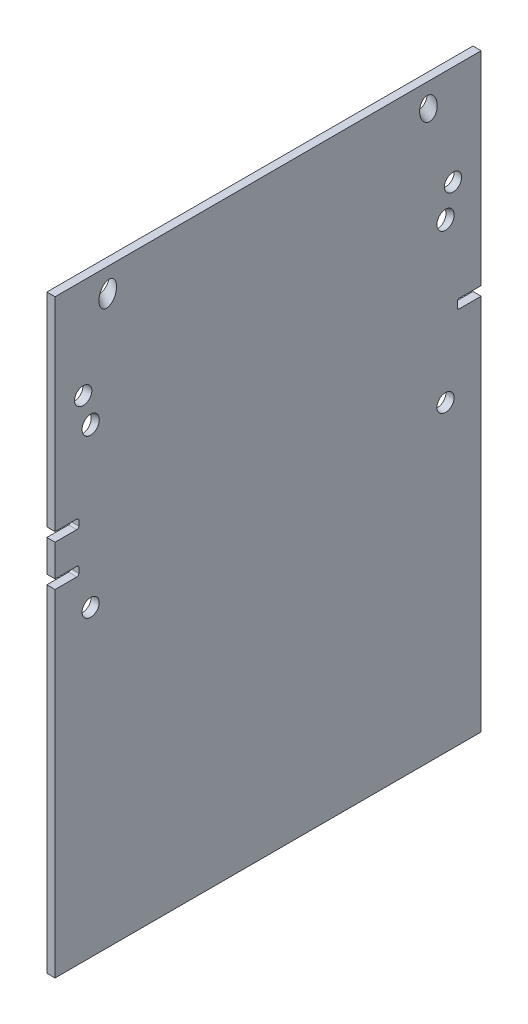
ISO-10303-21;
HEADER;
FILE_DESCRIPTION(('STEP AP214'),'2;1');
FILE_NAME('part.step','',(''),(''),'','','');
FILE_SCHEMA(('AUTOMOTIVE_DESIGN { 1 0 10303 214 1 1 1 1 }'));
ENDSEC;
DATA;
#1=APPLICATION_CONTEXT('core data for automotive mechanical design processes');
#2=APPLICATION_PROTOCOL_DEFINITION('international standard','automotive_design',2000,#1);
#3=PRODUCT_CONTEXT('',#1,'mechanical');
#4=PRODUCT('Part','Part','',(#3));
#5=PRODUCT_RELATED_PRODUCT_CATEGORY('part','',(#4));
#6=PRODUCT_DEFINITION_FORMATION('','',#4);
#7=PRODUCT_DEFINITION_CONTEXT('part definition',#1,'design');
#8=PRODUCT_DEFINITION('design','',#6,#7);
#9=PRODUCT_DEFINITION_SHAPE('','',#8);
#10=(LENGTH_UNIT() NAMED_UNIT(*) SI_UNIT(.MILLI.,.METRE.));
#11=(NAMED_UNIT(*) PLANE_ANGLE_UNIT() SI_UNIT($,.RADIAN.));
#12=(NAMED_UNIT(*) SI_UNIT($,.STERADIAN.) SOLID_ANGLE_UNIT());
#13=UNCERTAINTY_MEASURE_WITH_UNIT(LENGTH_MEASURE(1.E-05),#10,'distance_accuracy_value','');
#14=(GEOMETRIC_REPRESENTATION_CONTEXT(3) GLOBAL_UNCERTAINTY_ASSIGNED_CONTEXT((#13)) GLOBAL_UNIT_ASSIGNED_CONTEXT((#10,
#11,#12)) REPRESENTATION_CONTEXT('',''));
#15=CARTESIAN_POINT('',(0.,0.,0.));
#16=DIRECTION('',(0.,0.,1.));
#17=DIRECTION('',(1.,0.,0.));
#18=AXIS2_PLACEMENT_3D('',#15,#16,#17);
#19=CARTESIAN_POINT('',(2463.8,444.5,330.2));
#20=DIRECTION('',(0.,0.,-1.));
#21=DIRECTION('',(-1.,0.,0.));
#22=AXIS2_PLACEMENT_3D('',#19,#20,#21);
#23=PLANE('',#22);
#24=DIRECTION('',(0.,-1.,0.));
#25=VECTOR('',#24,1.);
#26=CARTESIAN_POINT('',(2463.8,444.5,330.2));
#27=LINE('',#26,#25);
#28=CARTESIAN_POINT('',(2463.8,115.038,330.2));
#29=VERTEX_POINT('',#28);
#30=CARTESIAN_POINT('',(2463.8,65.762,330.2));
#31=VERTEX_POINT('',#30);
#32=EDGE_CURVE('E218',#29,#31,#27,.T.);
#33=ORIENTED_EDGE('',*,*,#32,.T.);
#34=DIRECTION('',(1.,0.,0.));
#35=VECTOR('',#34,1.);
#36=CARTESIAN_POINT('',(2463.8,65.762,330.2));
#37=LINE('',#36,#35);
#38=CARTESIAN_POINT('',(2476.5,65.762,330.2));
#39=VERTEX_POINT('',#38);
#40=EDGE_CURVE('E300',#31,#39,#37,.T.);
#41=ORIENTED_EDGE('',*,*,#40,.T.);
#42=DIRECTION('',(0.,-1.,0.));
#43=VECTOR('',#42,1.);
#44=CARTESIAN_POINT('',(2476.5,444.5,330.2));
#45=LINE('',#44,#43);
#46=CARTESIAN_POINT('',(2476.5,115.038,330.2));
#47=VERTEX_POINT('',#46);
#48=EDGE_CURVE('E248',#47,#39,#45,.T.);
#49=ORIENTED_EDGE('',*,*,#48,.F.);
#50=DIRECTION('',(-1.,0.,0.));
#51=VECTOR('',#50,1.);
#52=CARTESIAN_POINT('',(2463.8,115.038,330.2));
#53=LINE('',#52,#51);
#54=EDGE_CURVE('E289',#47,#29,#53,.T.);
#55=ORIENTED_EDGE('',*,*,#54,.T.);
#56=EDGE_LOOP('',(#33,#41,#49,#55));
#57=FACE_BOUND('',#56,.T.);
#58=ADVANCED_FACE('F43',(#57),#23,.F.);
#59=CARTESIAN_POINT('',(2463.8,444.5,-330.2));
#60=DIRECTION('',(0.,0.,1.));
#61=DIRECTION('',(1.,0.,0.));
#62=AXIS2_PLACEMENT_3D('',#59,#60,#61);
#63=PLANE('',#62);
#64=DIRECTION('',(0.,-1.,0.));
#65=VECTOR('',#64,1.);
#66=CARTESIAN_POINT('',(2463.8,444.5,-330.2));
#67=LINE('',#66,#65);
#68=CARTESIAN_POINT('',(2463.8,115.038,-330.2));
#69=VERTEX_POINT('',#68);
#70=CARTESIAN_POINT('',(2463.8,-469.9,-330.2));
#71=VERTEX_POINT('',#70);
#72=EDGE_CURVE('E237',#69,#71,#67,.T.);
#73=ORIENTED_EDGE('',*,*,#72,.F.);
#74=DIRECTION('',(1.,0.,0.));
#75=VECTOR('',#74,1.);
#76=CARTESIAN_POINT('',(2463.8,115.038,-330.2));
#77=LINE('',#76,#75);
#78=CARTESIAN_POINT('',(2476.5,115.038,-330.2));
#79=VERTEX_POINT('',#78);
#80=EDGE_CURVE('E309',#69,#79,#77,.T.);
#81=ORIENTED_EDGE('',*,*,#80,.T.);
#82=DIRECTION('',(0.,-1.,0.));
#83=VECTOR('',#82,1.);
#84=CARTESIAN_POINT('',(2476.5,444.5,-330.2));
#85=LINE('',#84,#83);
#86=CARTESIAN_POINT('',(2476.5,-469.9,-330.2));
#87=VERTEX_POINT('',#86);
#88=EDGE_CURVE('E245',#79,#87,#85,.T.);
#89=ORIENTED_EDGE('',*,*,#88,.T.);
#90=DIRECTION('',(-1.,0.,0.));
#91=VECTOR('',#90,1.);
#92=CARTESIAN_POINT('',(2463.8,-469.9,-330.2));
#93=LINE('',#92,#91);
#94=EDGE_CURVE('E243',#87,#71,#93,.T.);
#95=ORIENTED_EDGE('',*,*,#94,.T.);
#96=EDGE_LOOP('',(#73,#81,#89,#95));
#97=FACE_BOUND('',#96,.T.);
#98=ADVANCED_FACE('F428',(#97),#63,.F.);
#99=CARTESIAN_POINT('',(2463.8,444.5,330.2));
#100=VERTEX_POINT('',#99);
#101=CARTESIAN_POINT('',(2463.8,129.262,330.2));
#102=VERTEX_POINT('',#101);
#103=EDGE_CURVE('E196',#100,#102,#27,.T.);
#104=ORIENTED_EDGE('',*,*,#103,.T.);
#105=DIRECTION('',(1.,0.,0.));
#106=VECTOR('',#105,1.);
#107=CARTESIAN_POINT('',(2463.8,129.262,330.2));
#108=LINE('',#107,#106);
#109=CARTESIAN_POINT('',(2476.5,129.262,330.2));
#110=VERTEX_POINT('',#109);
#111=EDGE_CURVE('E271',#102,#110,#108,.T.);
#112=ORIENTED_EDGE('',*,*,#111,.T.);
#113=CARTESIAN_POINT('',(2476.5,444.5,330.2));
#114=VERTEX_POINT('',#113);
#115=EDGE_CURVE('E198',#114,#110,#45,.T.);
#116=ORIENTED_EDGE('',*,*,#115,.F.);
#117=DIRECTION('',(1.,0.,0.));
#118=VECTOR('',#117,1.);
#119=CARTESIAN_POINT('',(2463.8,444.5,330.2));
#120=LINE('',#119,#118);
#121=EDGE_CURVE('E191',#100,#114,#120,.T.);
#122=ORIENTED_EDGE('',*,*,#121,.F.);
#123=EDGE_LOOP('',(#104,#112,#116,#122));
#124=FACE_BOUND('',#123,.T.);
#125=ADVANCED_FACE('F193',(#124),#23,.F.);
#126=CARTESIAN_POINT('',(2463.8,444.5,-330.2));
#127=DIRECTION('',(1.,0.,0.));
#128=DIRECTION('',(0.,0.,-1.));
#129=AXIS2_PLACEMENT_3D('',#126,#127,#128);
#130=PLANE('',#129);
#131=DIRECTION('',(0.,0.,-1.));
#132=VECTOR('',#131,1.);
#133=CARTESIAN_POINT('',(2463.8,51.538,-330.2));
#134=LINE('',#133,#132);
#135=CARTESIAN_POINT('',(2463.8,51.538,330.2));
#136=VERTEX_POINT('',#135);
#137=CARTESIAN_POINT('',(2463.8,51.538,296.463));
#138=VERTEX_POINT('',#137);
#139=EDGE_CURVE('E263',#136,#138,#134,.T.);
#140=ORIENTED_EDGE('',*,*,#139,.T.);
#141=CARTESIAN_POINT('',(2463.8,54.713,296.463));
#142=DIRECTION('',(1.,0.,0.));
#143=DIRECTION('',(0.,0.,-1.));
#144=AXIS2_PLACEMENT_3D('',#141,#142,#143);
#145=CIRCLE('',#144,3.175);
#146=CARTESIAN_POINT('',(2463.8,54.713,293.288));
#147=VERTEX_POINT('',#146);
#148=EDGE_CURVE('E401',#138,#147,#145,.T.);
#149=ORIENTED_EDGE('',*,*,#148,.T.);
#150=DIRECTION('',(0.,1.,0.));
#151=VECTOR('',#150,1.);
#152=CARTESIAN_POINT('',(2463.8,52.3,293.288));
#153=LINE('',#152,#151);
#154=CARTESIAN_POINT('',(2463.8,62.587,293.288));
#155=VERTEX_POINT('',#154);
#156=EDGE_CURVE('E264',#147,#155,#153,.T.);
#157=ORIENTED_EDGE('',*,*,#156,.T.);
#158=CARTESIAN_POINT('',(2463.8,62.587,296.463));
#159=DIRECTION('',(1.,0.,0.));
#160=DIRECTION('',(0.,0.,-1.));
#161=AXIS2_PLACEMENT_3D('',#158,#159,#160);
#162=CIRCLE('',#161,3.175);
#163=CARTESIAN_POINT('',(2463.8,65.762,296.463));
#164=VERTEX_POINT('',#163);
#165=EDGE_CURVE('E405',#155,#164,#162,.T.);
#166=ORIENTED_EDGE('',*,*,#165,.T.);
#167=DIRECTION('',(0.,0.,1.));
#168=VECTOR('',#167,1.);
#169=CARTESIAN_POINT('',(2463.8,65.762,-330.2));
#170=LINE('',#169,#168);
#171=EDGE_CURVE('E297',#164,#31,#170,.T.);
#172=ORIENTED_EDGE('',*,*,#171,.T.);
#173=ORIENTED_EDGE('',*,*,#32,.F.);
#174=DIRECTION('',(0.,0.,-1.));
#175=VECTOR('',#174,1.);
#176=CARTESIAN_POINT('',(2463.8,115.038,-330.2));
#177=LINE('',#176,#175);
#178=CARTESIAN_POINT('',(2463.8,115.038,296.463));
#179=VERTEX_POINT('',#178);
#180=EDGE_CURVE('E273',#29,#179,#177,.T.);
#181=ORIENTED_EDGE('',*,*,#180,.T.);
#182=CARTESIAN_POINT('',(2463.8,118.213,296.463));
#183=DIRECTION('',(1.,0.,0.));
#184=DIRECTION('',(0.,0.,-1.));
#185=AXIS2_PLACEMENT_3D('',#182,#183,#184);
#186=CIRCLE('',#185,3.175);
#187=CARTESIAN_POINT('',(2463.8,118.213,293.288));
#188=VERTEX_POINT('',#187);
#189=EDGE_CURVE('E397',#179,#188,#186,.T.);
#190=ORIENTED_EDGE('',*,*,#189,.T.);
#191=DIRECTION('',(0.,1.,0.));
#192=VECTOR('',#191,1.);
#193=CARTESIAN_POINT('',(2463.8,115.8,293.288));
#194=LINE('',#193,#192);
#195=CARTESIAN_POINT('',(2463.8,126.087,293.288));
#196=VERTEX_POINT('',#195);
#197=EDGE_CURVE('E276',#188,#196,#194,.T.);
#198=ORIENTED_EDGE('',*,*,#197,.T.);
#199=CARTESIAN_POINT('',(2463.8,126.087,296.463));
#200=DIRECTION('',(1.,0.,0.));
#201=DIRECTION('',(0.,0.,-1.));
#202=AXIS2_PLACEMENT_3D('',#199,#200,#201);
#203=CIRCLE('',#202,3.175);
#204=CARTESIAN_POINT('',(2463.8,129.262,296.463));
#205=VERTEX_POINT('',#204);
#206=EDGE_CURVE('E12',#196,#205,#203,.T.);
#207=ORIENTED_EDGE('',*,*,#206,.T.);
#208=DIRECTION('',(0.,0.,1.));
#209=VECTOR('',#208,1.);
#210=CARTESIAN_POINT('',(2463.8,129.262,-330.2));
#211=LINE('',#210,#209);
#212=EDGE_CURVE('E215',#205,#102,#211,.T.);
#213=ORIENTED_EDGE('',*,*,#212,.T.);
#214=ORIENTED_EDGE('',*,*,#103,.F.);
#215=DIRECTION('',(0.,0.,1.));
#216=VECTOR('',#215,1.);
#217=CARTESIAN_POINT('',(2463.8,444.5,-330.2));
#218=LINE('',#217,#216);
#219=CARTESIAN_POINT('',(2463.8,444.5,-330.2));
#220=VERTEX_POINT('',#219);
#221=EDGE_CURVE('E202',#220,#100,#218,.T.);
#222=ORIENTED_EDGE('',*,*,#221,.F.);
#223=CARTESIAN_POINT('',(2463.8,129.262,-330.2));
#224=VERTEX_POINT('',#223);
#225=EDGE_CURVE('E233',#220,#224,#67,.T.);
#226=ORIENTED_EDGE('',*,*,#225,.T.);
#227=DIRECTION('',(0.,0.,1.));
#228=VECTOR('',#227,1.);
#229=CARTESIAN_POINT('',(2463.8,129.262,-330.2));
#230=LINE('',#229,#228);
#231=CARTESIAN_POINT('',(2463.8,129.262,-296.463000000001));
#232=VERTEX_POINT('',#231);
#233=EDGE_CURVE('E795',#224,#232,#230,.T.);
#234=ORIENTED_EDGE('',*,*,#233,.T.);
#235=CARTESIAN_POINT('',(2463.8,126.087,-296.463000000001));
#236=DIRECTION('',(1.,0.,0.));
#237=DIRECTION('',(0.,0.,-1.));
#238=AXIS2_PLACEMENT_3D('',#235,#236,#237);
#239=CIRCLE('',#238,3.175);
#240=CARTESIAN_POINT('',(2463.8,126.087,-293.288000000001));
#241=VERTEX_POINT('',#240);
#242=EDGE_CURVE('E393',#232,#241,#239,.T.);
#243=ORIENTED_EDGE('',*,*,#242,.T.);
#244=DIRECTION('',(0.,-1.,0.));
#245=VECTOR('',#244,1.);
#246=CARTESIAN_POINT('',(2463.8,128.5,-293.288000000001));
#247=LINE('',#246,#245);
#248=CARTESIAN_POINT('',(2463.8,118.213,-293.288000000001));
#249=VERTEX_POINT('',#248);
#250=EDGE_CURVE('E796',#241,#249,#247,.T.);
#251=ORIENTED_EDGE('',*,*,#250,.T.);
#252=CARTESIAN_POINT('',(2463.8,118.213,-296.463000000001));
#253=DIRECTION('',(1.,0.,0.));
#254=DIRECTION('',(0.,0.,-1.));
#255=AXIS2_PLACEMENT_3D('',#252,#253,#254);
#256=CIRCLE('',#255,3.175);
#257=CARTESIAN_POINT('',(2463.8,115.038,-296.463000000001));
#258=VERTEX_POINT('',#257);
#259=EDGE_CURVE('E389',#249,#258,#256,.T.);
#260=ORIENTED_EDGE('',*,*,#259,.T.);
#261=DIRECTION('',(0.,0.,-1.));
#262=VECTOR('',#261,1.);
#263=CARTESIAN_POINT('',(2463.8,115.038,-330.2));
#264=LINE('',#263,#262);
#265=EDGE_CURVE('E286',#258,#69,#264,.T.);
#266=ORIENTED_EDGE('',*,*,#265,.T.);
#267=ORIENTED_EDGE('',*,*,#72,.T.);
#268=DIRECTION('',(0.,0.,1.));
#269=VECTOR('',#268,1.);
#270=CARTESIAN_POINT('',(2463.8,-469.9,-330.2));
#271=LINE('',#270,#269);
#272=CARTESIAN_POINT('',(2463.8,-469.9,330.2));
#273=VERTEX_POINT('',#272);
#274=EDGE_CURVE('E240',#71,#273,#271,.T.);
#275=ORIENTED_EDGE('',*,*,#274,.T.);
#276=EDGE_CURVE('E220',#136,#273,#27,.T.);
#277=ORIENTED_EDGE('',*,*,#276,.F.);
#278=EDGE_LOOP('',(#140,#149,#157,#166,#172,#173,#181,#190,#198,#207,#213,#214,#222,#226,#234,
#243,#251,#260,#266,#267,#275,#277));
#279=FACE_BOUND('',#278,.T.);
#280=CARTESIAN_POINT('',(2463.8,240.627500000009,-275.000000000001));
#281=DIRECTION('',(1.,0.,0.));
#282=DIRECTION('',(0.,1.,0.));
#283=AXIS2_PLACEMENT_3D('',#280,#281,#282);
#284=ELLIPSE('',#283,14.1841170593698,13.335);
#285=CARTESIAN_POINT('',(2463.8,254.811617059379,-275.000000000001));
#286=VERTEX_POINT('',#285);
#287=EDGE_CURVE('E288',#286,#286,#284,.F.);
#288=ORIENTED_EDGE('',*,*,#287,.F.);
#289=EDGE_LOOP('',(#288));
#290=FACE_BOUND('',#289,.T.);
#291=CARTESIAN_POINT('',(2463.8,-7.12133119048504E-13,-275.000000000001));
#292=DIRECTION('',(1.,0.,0.));
#293=DIRECTION('',(0.,0.,-1.));
#294=AXIS2_PLACEMENT_3D('',#291,#292,#293);
#295=CIRCLE('',#294,13.335);
#296=CARTESIAN_POINT('',(2463.8,-7.12133119048504E-13,-288.335000000001));
#297=VERTEX_POINT('',#296);
#298=EDGE_CURVE('E346',#297,#297,#295,.F.);
#299=ORIENTED_EDGE('',*,*,#298,.F.);
#300=EDGE_LOOP('',(#299));
#301=FACE_BOUND('',#300,.T.);
#302=CARTESIAN_POINT('',(2463.8,289.999999999994,-287.768749999998));
#303=DIRECTION('',(1.,0.,0.));
#304=DIRECTION('',(0.,-1.68753899743025E-13,-1.));
#305=AXIS2_PLACEMENT_3D('',#302,#303,#304);
#306=ELLIPSE('',#305,13.3934728748526,13.335);
#307=CARTESIAN_POINT('',(2463.8,289.999999999991,-301.16222287485));
#308=VERTEX_POINT('',#307);
#309=EDGE_CURVE('E347',#308,#308,#306,.F.);
#310=ORIENTED_EDGE('',*,*,#309,.F.);
#311=EDGE_LOOP('',(#310));
#312=FACE_BOUND('',#311,.T.);
#313=CARTESIAN_POINT('',(2463.8,419.804647774969,-245.782156472755));
#314=DIRECTION('',(1.,0.,0.));
#315=DIRECTION('',(0.,0.975590762994734,0.219596591866432));
#316=AXIS2_PLACEMENT_3D('',#313,#314,#315);
#317=ELLIPSE('',#316,18.6418967373264,13.3350000000001);
#318=CARTESIAN_POINT('',(2463.8,437.991510036606,-241.688459483312));
#319=VERTEX_POINT('',#318);
#320=EDGE_CURVE('E315',#319,#319,#317,.F.);
#321=ORIENTED_EDGE('',*,*,#320,.F.);
#322=EDGE_LOOP('',(#321));
#323=FACE_BOUND('',#322,.T.);
#324=CARTESIAN_POINT('',(2463.8,419.804647774969,245.782156472754));
#325=DIRECTION('',(1.,0.,0.));
#326=DIRECTION('',(0.,-0.975590762994734,0.219596591866431));
#327=AXIS2_PLACEMENT_3D('',#324,#325,#326);
#328=ELLIPSE('',#327,18.6418967373263,13.335);
#329=CARTESIAN_POINT('',(2463.8,401.617785513332,249.875853462197));
#330=VERTEX_POINT('',#329);
#331=EDGE_CURVE('E316',#330,#330,#328,.F.);
#332=ORIENTED_EDGE('',*,*,#331,.F.);
#333=EDGE_LOOP('',(#332));
#334=FACE_BOUND('',#333,.T.);
#335=CARTESIAN_POINT('',(2463.8,240.627500000009,275.));
#336=DIRECTION('',(1.,0.,0.));
#337=DIRECTION('',(0.,-1.,0.));
#338=AXIS2_PLACEMENT_3D('',#335,#336,#337);
#339=ELLIPSE('',#338,14.1841170593698,13.335);
#340=CARTESIAN_POINT('',(2463.8,226.443382940639,275.));
#341=VERTEX_POINT('',#340);
#342=EDGE_CURVE('E323',#341,#341,#339,.F.);
#343=ORIENTED_EDGE('',*,*,#342,.F.);
#344=EDGE_LOOP('',(#343));
#345=FACE_BOUND('',#344,.T.);
#346=CARTESIAN_POINT('',(2463.8,-4.18286707223905E-12,275.));
#347=DIRECTION('',(1.,0.,0.));
#348=DIRECTION('',(0.,0.,-1.));
#349=AXIS2_PLACEMENT_3D('',#346,#347,#348);
#350=CIRCLE('',#349,13.335);
#351=CARTESIAN_POINT('',(2463.8,-4.18286707223905E-12,261.665));
#352=VERTEX_POINT('',#351);
#353=EDGE_CURVE('E336',#352,#352,#350,.F.);
#354=ORIENTED_EDGE('',*,*,#353,.F.);
#355=EDGE_LOOP('',(#354));
#356=FACE_BOUND('',#355,.T.);
#357=CARTESIAN_POINT('',(2463.8,289.999999999994,287.768749999997));
#358=DIRECTION('',(1.,0.,0.));
#359=DIRECTION('',(0.,-1.70234197109192E-13,1.));
#360=AXIS2_PLACEMENT_3D('',#357,#358,#359);
#361=ELLIPSE('',#360,13.3934728748526,13.335);
#362=CARTESIAN_POINT('',(2463.8,289.999999999991,301.162222874849));
#363=VERTEX_POINT('',#362);
#364=EDGE_CURVE('E329',#363,#363,#361,.F.);
#365=ORIENTED_EDGE('',*,*,#364,.F.);
#366=EDGE_LOOP('',(#365));
#367=FACE_BOUND('',#366,.T.);
#368=ADVANCED_FACE('F213',(#279,#290,#301,#312,#323,#334,#345,#356,#367),#130,.F.);
#369=CARTESIAN_POINT('',(2476.5,51.538,330.2));
#370=VERTEX_POINT('',#369);
#371=CARTESIAN_POINT('',(2476.5,-469.9,330.2));
#372=VERTEX_POINT('',#371);
#373=EDGE_CURVE('E222',#370,#372,#45,.T.);
#374=ORIENTED_EDGE('',*,*,#373,.F.);
#375=DIRECTION('',(-1.,0.,0.));
#376=VECTOR('',#375,1.);
#377=CARTESIAN_POINT('',(2463.8,51.538,330.2));
#378=LINE('',#377,#376);
#379=EDGE_CURVE('E261',#370,#136,#378,.T.);
#380=ORIENTED_EDGE('',*,*,#379,.T.);
#381=ORIENTED_EDGE('',*,*,#276,.T.);
#382=DIRECTION('',(1.,0.,0.));
#383=VECTOR('',#382,1.);
#384=CARTESIAN_POINT('',(2463.8,-469.9,330.2));
#385=LINE('',#384,#383);
#386=EDGE_CURVE('E227',#273,#372,#385,.T.);
#387=ORIENTED_EDGE('',*,*,#386,.T.);
#388=EDGE_LOOP('',(#374,#380,#381,#387));
#389=FACE_BOUND('',#388,.T.);
#390=ADVANCED_FACE('F260',(#389),#23,.F.);
#391=CARTESIAN_POINT('',(2476.5,444.5,-330.2));
#392=DIRECTION('',(-1.,0.,0.));
#393=DIRECTION('',(0.,0.,1.));
#394=AXIS2_PLACEMENT_3D('',#391,#392,#393);
#395=PLANE('',#394);
#396=DIRECTION('',(0.,1.,0.));
#397=VECTOR('',#396,1.);
#398=CARTESIAN_POINT('',(2476.5,444.5,293.288));
#399=LINE('',#398,#397);
#400=CARTESIAN_POINT('',(2476.5,54.713,293.288));
#401=VERTEX_POINT('',#400);
#402=CARTESIAN_POINT('',(2476.5,62.5869999999999,293.288));
#403=VERTEX_POINT('',#402);
#404=EDGE_CURVE('E296',#401,#403,#399,.T.);
#405=ORIENTED_EDGE('',*,*,#404,.F.);
#406=CARTESIAN_POINT('',(2476.5,54.713,296.463));
#407=DIRECTION('',(-1.,0.,0.));
#408=DIRECTION('',(0.,0.,1.));
#409=AXIS2_PLACEMENT_3D('',#406,#407,#408);
#410=CIRCLE('',#409,3.175);
#411=CARTESIAN_POINT('',(2476.5,51.538,296.463));
#412=VERTEX_POINT('',#411);
#413=EDGE_CURVE('E399',#401,#412,#410,.T.);
#414=ORIENTED_EDGE('',*,*,#413,.T.);
#415=DIRECTION('',(0.,0.,1.));
#416=VECTOR('',#415,1.);
#417=CARTESIAN_POINT('',(2476.5,51.538,-330.2));
#418=LINE('',#417,#416);
#419=EDGE_CURVE('E258',#412,#370,#418,.T.);
#420=ORIENTED_EDGE('',*,*,#419,.T.);
#421=ORIENTED_EDGE('',*,*,#373,.T.);
#422=DIRECTION('',(0.,0.,-1.));
#423=VECTOR('',#422,1.);
#424=CARTESIAN_POINT('',(2476.5,-469.9,-330.2));
#425=LINE('',#424,#423);
#426=EDGE_CURVE('E217',#372,#87,#425,.T.);
#427=ORIENTED_EDGE('',*,*,#426,.T.);
#428=ORIENTED_EDGE('',*,*,#88,.F.);
#429=DIRECTION('',(0.,0.,1.));
#430=VECTOR('',#429,1.);
#431=CARTESIAN_POINT('',(2476.5,115.038,-330.2));
#432=LINE('',#431,#430);
#433=CARTESIAN_POINT('',(2476.5,115.038,-296.463000000001));
#434=VERTEX_POINT('',#433);
#435=EDGE_CURVE('E803',#79,#434,#432,.T.);
#436=ORIENTED_EDGE('',*,*,#435,.T.);
#437=CARTESIAN_POINT('',(2476.5,118.213,-296.463000000001));
#438=DIRECTION('',(-1.,0.,0.));
#439=DIRECTION('',(0.,0.,1.));
#440=AXIS2_PLACEMENT_3D('',#437,#438,#439);
#441=CIRCLE('',#440,3.175);
#442=CARTESIAN_POINT('',(2476.5,118.213,-293.288000000001));
#443=VERTEX_POINT('',#442);
#444=EDGE_CURVE('E387',#434,#443,#441,.T.);
#445=ORIENTED_EDGE('',*,*,#444,.T.);
#446=DIRECTION('',(0.,-1.,0.));
#447=VECTOR('',#446,1.);
#448=CARTESIAN_POINT('',(2476.5,444.5,-293.288000000001));
#449=LINE('',#448,#447);
#450=CARTESIAN_POINT('',(2476.5,126.087,-293.288000000001));
#451=VERTEX_POINT('',#450);
#452=EDGE_CURVE('E299',#451,#443,#449,.T.);
#453=ORIENTED_EDGE('',*,*,#452,.F.);
#454=CARTESIAN_POINT('',(2476.5,126.087,-296.463000000001));
#455=DIRECTION('',(-1.,0.,0.));
#456=DIRECTION('',(0.,0.,1.));
#457=AXIS2_PLACEMENT_3D('',#454,#455,#456);
#458=CIRCLE('',#457,3.175);
#459=CARTESIAN_POINT('',(2476.5,129.262,-296.463000000001));
#460=VERTEX_POINT('',#459);
#461=EDGE_CURVE('E391',#451,#460,#458,.T.);
#462=ORIENTED_EDGE('',*,*,#461,.T.);
#463=DIRECTION('',(0.,0.,-1.));
#464=VECTOR('',#463,1.);
#465=CARTESIAN_POINT('',(2476.5,129.262,-330.2));
#466=LINE('',#465,#464);
#467=CARTESIAN_POINT('',(2476.5,129.262,-330.2));
#468=VERTEX_POINT('',#467);
#469=EDGE_CURVE('E792',#460,#468,#466,.T.);
#470=ORIENTED_EDGE('',*,*,#469,.T.);
#471=CARTESIAN_POINT('',(2476.5,444.5,-330.2));
#472=VERTEX_POINT('',#471);
#473=EDGE_CURVE('E210',#472,#468,#85,.T.);
#474=ORIENTED_EDGE('',*,*,#473,.F.);
#475=DIRECTION('',(0.,0.,-1.));
#476=VECTOR('',#475,1.);
#477=CARTESIAN_POINT('',(2476.5,444.5,-330.2));
#478=LINE('',#477,#476);
#479=EDGE_CURVE('E201',#114,#472,#478,.T.);
#480=ORIENTED_EDGE('',*,*,#479,.F.);
#481=ORIENTED_EDGE('',*,*,#115,.T.);
#482=DIRECTION('',(0.,0.,-1.));
#483=VECTOR('',#482,1.);
#484=CARTESIAN_POINT('',(2476.5,129.262,-330.2));
#485=LINE('',#484,#483);
#486=CARTESIAN_POINT('',(2476.5,129.262,296.463));
#487=VERTEX_POINT('',#486);
#488=EDGE_CURVE('E279',#110,#487,#485,.T.);
#489=ORIENTED_EDGE('',*,*,#488,.T.);
#490=CARTESIAN_POINT('',(2476.5,126.087,296.463));
#491=DIRECTION('',(-1.,0.,0.));
#492=DIRECTION('',(0.,0.,1.));
#493=AXIS2_PLACEMENT_3D('',#490,#491,#492);
#494=CIRCLE('',#493,3.175);
#495=CARTESIAN_POINT('',(2476.5,126.087,293.288));
#496=VERTEX_POINT('',#495);
#497=EDGE_CURVE('E51',#487,#496,#494,.T.);
#498=ORIENTED_EDGE('',*,*,#497,.T.);
#499=DIRECTION('',(0.,1.,0.));
#500=VECTOR('',#499,1.);
#501=CARTESIAN_POINT('',(2476.5,444.5,293.288));
#502=LINE('',#501,#500);
#503=CARTESIAN_POINT('',(2476.5,118.213,293.288));
#504=VERTEX_POINT('',#503);
#505=EDGE_CURVE('E283',#504,#496,#502,.T.);
#506=ORIENTED_EDGE('',*,*,#505,.F.);
#507=CARTESIAN_POINT('',(2476.5,118.213,296.463));
#508=DIRECTION('',(-1.,0.,0.));
#509=DIRECTION('',(0.,0.,1.));
#510=AXIS2_PLACEMENT_3D('',#507,#508,#509);
#511=CIRCLE('',#510,3.175);
#512=CARTESIAN_POINT('',(2476.5,115.038,296.463));
#513=VERTEX_POINT('',#512);
#514=EDGE_CURVE('E395',#504,#513,#511,.T.);
#515=ORIENTED_EDGE('',*,*,#514,.T.);
#516=DIRECTION('',(0.,0.,1.));
#517=VECTOR('',#516,1.);
#518=CARTESIAN_POINT('',(2476.5,115.038,-330.2));
#519=LINE('',#518,#517);
#520=EDGE_CURVE('E282',#513,#47,#519,.T.);
#521=ORIENTED_EDGE('',*,*,#520,.T.);
#522=ORIENTED_EDGE('',*,*,#48,.T.);
#523=DIRECTION('',(0.,0.,-1.));
#524=VECTOR('',#523,1.);
#525=CARTESIAN_POINT('',(2476.5,65.762,-330.2));
#526=LINE('',#525,#524);
#527=CARTESIAN_POINT('',(2476.5,65.762,296.463));
#528=VERTEX_POINT('',#527);
#529=EDGE_CURVE('E303',#39,#528,#526,.T.);
#530=ORIENTED_EDGE('',*,*,#529,.T.);
#531=CARTESIAN_POINT('',(2476.5,62.587,296.463));
#532=DIRECTION('',(-1.,0.,0.));
#533=DIRECTION('',(0.,0.,1.));
#534=AXIS2_PLACEMENT_3D('',#531,#532,#533);
#535=CIRCLE('',#534,3.175);
#536=EDGE_CURVE('E403',#528,#403,#535,.T.);
#537=ORIENTED_EDGE('',*,*,#536,.T.);
#538=EDGE_LOOP('',(#405,#414,#420,#421,#427,#428,#436,#445,#453,#462,#470,#474,#480,#481,#489,
#498,#506,#515,#521,#522,#530,#537));
#539=FACE_BOUND('',#538,.T.);
#540=CARTESIAN_POINT('',(2476.5,245.231250000009,-275.000000000001));
#541=DIRECTION('',(-1.,0.,0.));
#542=DIRECTION('',(0.,1.,0.));
#543=AXIS2_PLACEMENT_3D('',#540,#541,#542);
#544=ELLIPSE('',#543,14.1841170593698,13.335);
#545=CARTESIAN_POINT('',(2476.5,259.415367059379,-275.000000000001));
#546=VERTEX_POINT('',#545);
#547=EDGE_CURVE('E350',#546,#546,#544,.F.);
#548=ORIENTED_EDGE('',*,*,#547,.F.);
#549=EDGE_LOOP('',(#548));
#550=FACE_BOUND('',#549,.T.);
#551=CARTESIAN_POINT('',(2476.5,-6.45730104276708E-13,-275.000000000001));
#552=DIRECTION('',(-1.,0.,0.));
#553=DIRECTION('',(0.,0.,1.));
#554=AXIS2_PLACEMENT_3D('',#551,#552,#553);
#555=CIRCLE('',#554,13.335);
#556=CARTESIAN_POINT('',(2476.5,-6.45730104276708E-13,-261.665000000001));
#557=VERTEX_POINT('',#556);
#558=EDGE_CURVE('E343',#557,#557,#555,.F.);
#559=ORIENTED_EDGE('',*,*,#558,.F.);
#560=EDGE_LOOP('',(#559));
#561=FACE_BOUND('',#560,.T.);
#562=CARTESIAN_POINT('',(2476.5,289.999999999994,-286.578124999997));
#563=DIRECTION('',(-1.,0.,0.));
#564=DIRECTION('',(0.,-1.68753899743025E-13,-1.));
#565=AXIS2_PLACEMENT_3D('',#562,#563,#564);
#566=ELLIPSE('',#565,13.3934728748526,13.335);
#567=CARTESIAN_POINT('',(2476.5,289.999999999991,-299.97159787485));
#568=VERTEX_POINT('',#567);
#569=EDGE_CURVE('E319',#568,#568,#566,.F.);
#570=ORIENTED_EDGE('',*,*,#569,.F.);
#571=EDGE_LOOP('',(#570));
#572=FACE_BOUND('',#571,.T.);
#573=CARTESIAN_POINT('',(2476.5,407.700983848811,-248.506580942624));
#574=DIRECTION('',(-1.,0.,0.));
#575=DIRECTION('',(0.,0.975590762994734,0.219596591866432));
#576=AXIS2_PLACEMENT_3D('',#573,#574,#575);
#577=ELLIPSE('',#576,18.6418967373264,13.3350000000001);
#578=CARTESIAN_POINT('',(2476.5,425.887846110449,-244.412883953181));
#579=VERTEX_POINT('',#578);
#580=EDGE_CURVE('E312',#579,#579,#577,.F.);
#581=ORIENTED_EDGE('',*,*,#580,.F.);
#582=EDGE_LOOP('',(#581));
#583=FACE_BOUND('',#582,.T.);
#584=CARTESIAN_POINT('',(2476.5,407.700983848812,248.506580942623));
#585=DIRECTION('',(-1.,0.,0.));
#586=DIRECTION('',(0.,-0.975590762994734,0.219596591866431));
#587=AXIS2_PLACEMENT_3D('',#584,#585,#586);
#588=ELLIPSE('',#587,18.6418967373263,13.335);
#589=CARTESIAN_POINT('',(2476.5,389.514121587175,252.600277932066));
#590=VERTEX_POINT('',#589);
#591=EDGE_CURVE('E320',#590,#590,#588,.F.);
#592=ORIENTED_EDGE('',*,*,#591,.F.);
#593=EDGE_LOOP('',(#592));
#594=FACE_BOUND('',#593,.T.);
#595=CARTESIAN_POINT('',(2476.5,245.231250000009,275.));
#596=DIRECTION('',(-1.,0.,0.));
#597=DIRECTION('',(0.,-1.,0.));
#598=AXIS2_PLACEMENT_3D('',#595,#596,#597);
#599=ELLIPSE('',#598,14.1841170593698,13.335);
#600=CARTESIAN_POINT('',(2476.5,231.047132940639,275.));
#601=VERTEX_POINT('',#600);
#602=EDGE_CURVE('E333',#601,#601,#599,.F.);
#603=ORIENTED_EDGE('',*,*,#602,.F.);
#604=EDGE_LOOP('',(#603));
#605=FACE_BOUND('',#604,.T.);
#606=CARTESIAN_POINT('',(2476.5,-4.18286707223905E-12,275.));
#607=DIRECTION('',(-1.,0.,0.));
#608=DIRECTION('',(0.,0.,1.));
#609=AXIS2_PLACEMENT_3D('',#606,#607,#608);
#610=CIRCLE('',#609,13.335);
#611=CARTESIAN_POINT('',(2476.5,-4.18286707223905E-12,288.335));
#612=VERTEX_POINT('',#611);
#613=EDGE_CURVE('E332',#612,#612,#610,.F.);
#614=ORIENTED_EDGE('',*,*,#613,.F.);
#615=EDGE_LOOP('',(#614));
#616=FACE_BOUND('',#615,.T.);
#617=CARTESIAN_POINT('',(2476.5,289.999999999994,286.578124999997));
#618=DIRECTION('',(-1.,0.,0.));
#619=DIRECTION('',(0.,-1.70234197109192E-13,1.));
#620=AXIS2_PLACEMENT_3D('',#617,#618,#619);
#621=ELLIPSE('',#620,13.3934728748526,13.335);
#622=CARTESIAN_POINT('',(2476.5,289.999999999992,299.971597874849));
#623=VERTEX_POINT('',#622);
#624=EDGE_CURVE('E326',#623,#623,#621,.F.);
#625=ORIENTED_EDGE('',*,*,#624,.F.);
#626=EDGE_LOOP('',(#625));
#627=FACE_BOUND('',#626,.T.);
#628=ADVANCED_FACE('F253',(#539,#550,#561,#572,#583,#594,#605,#616,#627),#395,.F.);
#629=ORIENTED_EDGE('',*,*,#473,.T.);
#630=DIRECTION('',(-1.,0.,0.));
#631=VECTOR('',#630,1.);
#632=CARTESIAN_POINT('',(2463.8,129.262,-330.2));
#633=LINE('',#632,#631);
#634=EDGE_CURVE('E281',#468,#224,#633,.T.);
#635=ORIENTED_EDGE('',*,*,#634,.T.);
#636=ORIENTED_EDGE('',*,*,#225,.F.);
#637=DIRECTION('',(-1.,0.,0.));
#638=VECTOR('',#637,1.);
#639=CARTESIAN_POINT('',(2463.8,444.5,-330.2));
#640=LINE('',#639,#638);
#641=EDGE_CURVE('E207',#472,#220,#640,.T.);
#642=ORIENTED_EDGE('',*,*,#641,.F.);
#643=EDGE_LOOP('',(#629,#635,#636,#642));
#644=FACE_BOUND('',#643,.T.);
#645=ADVANCED_FACE('F436',(#644),#63,.F.);
#646=CARTESIAN_POINT('',(0.,444.5,0.));
#647=DIRECTION('',(0.,1.,0.));
#648=DIRECTION('',(0.,0.,1.));
#649=AXIS2_PLACEMENT_3D('',#646,#647,#648);
#650=PLANE('',#649);
#651=ORIENTED_EDGE('',*,*,#221,.T.);
#652=ORIENTED_EDGE('',*,*,#121,.T.);
#653=ORIENTED_EDGE('',*,*,#479,.T.);
#654=ORIENTED_EDGE('',*,*,#641,.T.);
#655=EDGE_LOOP('',(#651,#652,#653,#654));
#656=FACE_BOUND('',#655,.T.);
#657=ADVANCED_FACE('F205',(#656),#650,.T.);
#658=CARTESIAN_POINT('',(0.,-469.9,0.));
#659=DIRECTION('',(0.,1.,0.));
#660=DIRECTION('',(0.,0.,1.));
#661=AXIS2_PLACEMENT_3D('',#658,#659,#660);
#662=PLANE('',#661);
#663=ORIENTED_EDGE('',*,*,#274,.F.);
#664=ORIENTED_EDGE('',*,*,#94,.F.);
#665=ORIENTED_EDGE('',*,*,#426,.F.);
#666=ORIENTED_EDGE('',*,*,#386,.F.);
#667=EDGE_LOOP('',(#663,#664,#665,#666));
#668=FACE_BOUND('',#667,.T.);
#669=ADVANCED_FACE('F498',(#668),#662,.F.);
#670=CARTESIAN_POINT('',(2599.99999999996,289.999999999996,275.));
#671=DIRECTION('',(-0.995634226059288,0.,0.0933407086930576));
#672=DIRECTION('',(0.0933407086930577,0.,0.995634226059288));
#673=AXIS2_PLACEMENT_3D('',#670,#671,#672);
#674=CYLINDRICAL_SURFACE('',#673,13.335);
#675=ORIENTED_EDGE('',*,*,#624,.T.);
#676=EDGE_LOOP('',(#675));
#677=FACE_BOUND('',#676,.T.);
#678=ORIENTED_EDGE('',*,*,#364,.T.);
#679=EDGE_LOOP('',(#678));
#680=FACE_BOUND('',#679,.T.);
#681=ADVANCED_FACE('F491',(#677,#680),#674,.F.);
#682=CARTESIAN_POINT('',(2599.99999999996,-4.18286707223905E-12,275.));
#683=DIRECTION('',(-1.,0.,0.));
#684=DIRECTION('',(0.,0.,1.));
#685=AXIS2_PLACEMENT_3D('',#682,#683,#684);
#686=CYLINDRICAL_SURFACE('',#685,13.335);
#687=ORIENTED_EDGE('',*,*,#613,.T.);
#688=EDGE_LOOP('',(#687));
#689=FACE_BOUND('',#688,.T.);
#690=ORIENTED_EDGE('',*,*,#353,.T.);
#691=EDGE_LOOP('',(#690));
#692=FACE_BOUND('',#691,.T.);
#693=ADVANCED_FACE('F487',(#689,#692),#686,.F.);
#694=CARTESIAN_POINT('',(2599.99999999996,289.999999999996,275.));
#695=DIRECTION('',(-0.940136065162483,-0.3407993236214,0.));
#696=DIRECTION('',(0.3407993236214,-0.940136065162483,0.));
#697=AXIS2_PLACEMENT_3D('',#694,#695,#696);
#698=CYLINDRICAL_SURFACE('',#697,13.335);
#699=ORIENTED_EDGE('',*,*,#602,.T.);
#700=EDGE_LOOP('',(#699));
#701=FACE_BOUND('',#700,.T.);
#702=ORIENTED_EDGE('',*,*,#342,.T.);
#703=EDGE_LOOP('',(#702));
#704=FACE_BOUND('',#703,.T.);
#705=ADVANCED_FACE('F490',(#701,#704),#698,.F.);
#706=CARTESIAN_POINT('',(1799.99999999996,1052.43552290753,103.38271055945));
#707=DIRECTION('',(0.715324206967608,-0.681735732234708,0.153452501838741));
#708=DIRECTION('',(0.689906973200086,0.723898037246887,0.));
#709=AXIS2_PLACEMENT_3D('',#706,#707,#708);
#710=CYLINDRICAL_SURFACE('',#709,13.335);
#711=ORIENTED_EDGE('',*,*,#591,.T.);
#712=EDGE_LOOP('',(#711));
#713=FACE_BOUND('',#712,.T.);
#714=ORIENTED_EDGE('',*,*,#331,.T.);
#715=EDGE_LOOP('',(#714));
#716=FACE_BOUND('',#715,.T.);
#717=ADVANCED_FACE('F479',(#713,#716),#710,.F.);
#718=CARTESIAN_POINT('',(2599.99999999996,289.999999999996,-275.000000000001));
#719=DIRECTION('',(-0.715324206967608,0.681735732234708,0.153452501838741));
#720=DIRECTION('',(-0.689906973200086,-0.723898037246887,0.));
#721=AXIS2_PLACEMENT_3D('',#718,#719,#720);
#722=CYLINDRICAL_SURFACE('',#721,13.3350000000001);
#723=ORIENTED_EDGE('',*,*,#580,.T.);
#724=EDGE_LOOP('',(#723));
#725=FACE_BOUND('',#724,.T.);
#726=ORIENTED_EDGE('',*,*,#320,.T.);
#727=EDGE_LOOP('',(#726));
#728=FACE_BOUND('',#727,.T.);
#729=ADVANCED_FACE('F475',(#725,#728),#722,.F.);
#730=CARTESIAN_POINT('',(2599.99999999996,289.999999999996,-275.000000000001));
#731=DIRECTION('',(-0.995634226059288,0.,-0.0933407086930576));
#732=DIRECTION('',(-0.0933407086930577,0.,0.995634226059288));
#733=AXIS2_PLACEMENT_3D('',#730,#731,#732);
#734=CYLINDRICAL_SURFACE('',#733,13.335);
#735=ORIENTED_EDGE('',*,*,#569,.T.);
#736=EDGE_LOOP('',(#735));
#737=FACE_BOUND('',#736,.T.);
#738=ORIENTED_EDGE('',*,*,#309,.T.);
#739=EDGE_LOOP('',(#738));
#740=FACE_BOUND('',#739,.T.);
#741=ADVANCED_FACE('F478',(#737,#740),#734,.F.);
#742=CARTESIAN_POINT('',(1799.99999999996,-4.18286707223905E-12,-275.000000000001));
#743=DIRECTION('',(1.,0.,0.));
#744=DIRECTION('',(0.,1.,0.));
#745=AXIS2_PLACEMENT_3D('',#742,#743,#744);
#746=CYLINDRICAL_SURFACE('',#745,13.335);
#747=ORIENTED_EDGE('',*,*,#558,.T.);
#748=EDGE_LOOP('',(#747));
#749=FACE_BOUND('',#748,.T.);
#750=ORIENTED_EDGE('',*,*,#298,.T.);
#751=EDGE_LOOP('',(#750));
#752=FACE_BOUND('',#751,.T.);
#753=ADVANCED_FACE('F423',(#749,#752),#746,.F.);
#754=CARTESIAN_POINT('',(1799.99999999996,-4.27435864480685E-12,-275.000000000001));
#755=DIRECTION('',(0.940136065162483,0.3407993236214,0.));
#756=DIRECTION('',(-0.3407993236214,0.940136065162483,0.));
#757=AXIS2_PLACEMENT_3D('',#754,#755,#756);
#758=CYLINDRICAL_SURFACE('',#757,13.335);
#759=ORIENTED_EDGE('',*,*,#547,.T.);
#760=EDGE_LOOP('',(#759));
#761=FACE_BOUND('',#760,.T.);
#762=ORIENTED_EDGE('',*,*,#287,.T.);
#763=EDGE_LOOP('',(#762));
#764=FACE_BOUND('',#763,.T.);
#765=ADVANCED_FACE('F415',(#761,#764),#758,.F.);
#766=CARTESIAN_POINT('',(2260.6,129.262,249.6));
#767=DIRECTION('',(0.,1.,0.));
#768=DIRECTION('',(0.,0.,1.));
#769=AXIS2_PLACEMENT_3D('',#766,#767,#768);
#770=PLANE('',#769);
#771=ORIENTED_EDGE('',*,*,#212,.F.);
#772=DIRECTION('',(1.,0.,0.));
#773=VECTOR('',#772,1.);
#774=CARTESIAN_POINT('',(2260.6,129.262,296.463000000001));
#775=LINE('',#774,#773);
#776=EDGE_CURVE('E385',#205,#487,#775,.T.);
#777=ORIENTED_EDGE('',*,*,#776,.T.);
#778=ORIENTED_EDGE('',*,*,#488,.F.);
#779=ORIENTED_EDGE('',*,*,#111,.F.);
#780=EDGE_LOOP('',(#771,#777,#778,#779));
#781=FACE_BOUND('',#780,.T.);
#782=ADVANCED_FACE('F412',(#781),#770,.F.);
#783=CARTESIAN_POINT('',(2260.6,115.038,249.6));
#784=DIRECTION('',(0.,-1.,0.));
#785=DIRECTION('',(0.,0.,-1.));
#786=AXIS2_PLACEMENT_3D('',#783,#784,#785);
#787=PLANE('',#786);
#788=ORIENTED_EDGE('',*,*,#520,.F.);
#789=DIRECTION('',(1.,0.,0.));
#790=VECTOR('',#789,1.);
#791=CARTESIAN_POINT('',(2260.6,115.038,296.463000000001));
#792=LINE('',#791,#790);
#793=EDGE_CURVE('E373',#513,#179,#792,.F.);
#794=ORIENTED_EDGE('',*,*,#793,.T.);
#795=ORIENTED_EDGE('',*,*,#180,.F.);
#796=ORIENTED_EDGE('',*,*,#54,.F.);
#797=EDGE_LOOP('',(#788,#794,#795,#796));
#798=FACE_BOUND('',#797,.T.);
#799=ADVANCED_FACE('F414',(#798),#787,.F.);
#800=CARTESIAN_POINT('',(2476.5,115.8,293.288));
#801=DIRECTION('',(0.,0.,1.));
#802=DIRECTION('',(1.,0.,0.));
#803=AXIS2_PLACEMENT_3D('',#800,#801,#802);
#804=PLANE('',#803);
#805=ORIENTED_EDGE('',*,*,#197,.F.);
#806=DIRECTION('',(1.,0.,0.));
#807=VECTOR('',#806,1.);
#808=CARTESIAN_POINT('',(2476.5,118.213,293.288));
#809=LINE('',#808,#807);
#810=EDGE_CURVE('E370',#188,#504,#809,.T.);
#811=ORIENTED_EDGE('',*,*,#810,.T.);
#812=ORIENTED_EDGE('',*,*,#505,.T.);
#813=DIRECTION('',(1.,0.,0.));
#814=VECTOR('',#813,1.);
#815=CARTESIAN_POINT('',(2476.5,126.087,293.288));
#816=LINE('',#815,#814);
#817=EDGE_CURVE('E368',#496,#196,#816,.F.);
#818=ORIENTED_EDGE('',*,*,#817,.T.);
#819=EDGE_LOOP('',(#805,#811,#812,#818));
#820=FACE_BOUND('',#819,.T.);
#821=ADVANCED_FACE('F409',(#820),#804,.T.);
#822=CARTESIAN_POINT('',(2260.6,115.038,-249.600000000001));
#823=DIRECTION('',(0.,-1.,0.));
#824=DIRECTION('',(0.,0.,-1.));
#825=AXIS2_PLACEMENT_3D('',#822,#823,#824);
#826=PLANE('',#825);
#827=ORIENTED_EDGE('',*,*,#265,.F.);
#828=DIRECTION('',(1.,0.,0.));
#829=VECTOR('',#828,1.);
#830=CARTESIAN_POINT('',(2260.6,115.038,-296.463000000002));
#831=LINE('',#830,#829);
#832=EDGE_CURVE('E306',#258,#434,#831,.T.);
#833=ORIENTED_EDGE('',*,*,#832,.T.);
#834=ORIENTED_EDGE('',*,*,#435,.F.);
#835=ORIENTED_EDGE('',*,*,#80,.F.);
#836=EDGE_LOOP('',(#827,#833,#834,#835));
#837=FACE_BOUND('',#836,.T.);
#838=ADVANCED_FACE('F460',(#837),#826,.F.);
#839=CARTESIAN_POINT('',(2260.6,129.262,-249.600000000001));
#840=DIRECTION('',(0.,1.,0.));
#841=DIRECTION('',(0.,0.,1.));
#842=AXIS2_PLACEMENT_3D('',#839,#840,#841);
#843=PLANE('',#842);
#844=ORIENTED_EDGE('',*,*,#469,.F.);
#845=DIRECTION('',(1.,0.,0.));
#846=VECTOR('',#845,1.);
#847=CARTESIAN_POINT('',(2260.6,129.262,-296.463000000002));
#848=LINE('',#847,#846);
#849=EDGE_CURVE('E366',#460,#232,#848,.F.);
#850=ORIENTED_EDGE('',*,*,#849,.T.);
#851=ORIENTED_EDGE('',*,*,#233,.F.);
#852=ORIENTED_EDGE('',*,*,#634,.F.);
#853=EDGE_LOOP('',(#844,#850,#851,#852));
#854=FACE_BOUND('',#853,.T.);
#855=ADVANCED_FACE('F452',(#854),#843,.F.);
#856=CARTESIAN_POINT('',(2476.5,128.5,-293.288000000001));
#857=DIRECTION('',(0.,0.,-1.));
#858=DIRECTION('',(1.,0.,0.));
#859=AXIS2_PLACEMENT_3D('',#856,#857,#858);
#860=PLANE('',#859);
#861=ORIENTED_EDGE('',*,*,#452,.T.);
#862=DIRECTION('',(1.,0.,0.));
#863=VECTOR('',#862,1.);
#864=CARTESIAN_POINT('',(2476.5,118.213,-293.288000000001));
#865=LINE('',#864,#863);
#866=EDGE_CURVE('E364',#443,#249,#865,.F.);
#867=ORIENTED_EDGE('',*,*,#866,.T.);
#868=ORIENTED_EDGE('',*,*,#250,.F.);
#869=DIRECTION('',(1.,0.,0.));
#870=VECTOR('',#869,1.);
#871=CARTESIAN_POINT('',(2476.5,126.087,-293.288000000001));
#872=LINE('',#871,#870);
#873=EDGE_CURVE('E361',#241,#451,#872,.T.);
#874=ORIENTED_EDGE('',*,*,#873,.T.);
#875=EDGE_LOOP('',(#861,#867,#868,#874));
#876=FACE_BOUND('',#875,.T.);
#877=ADVANCED_FACE('F448',(#876),#860,.T.);
#878=CARTESIAN_POINT('',(2260.6,65.762,249.6));
#879=DIRECTION('',(0.,1.,0.));
#880=DIRECTION('',(0.,0.,1.));
#881=AXIS2_PLACEMENT_3D('',#878,#879,#880);
#882=PLANE('',#881);
#883=ORIENTED_EDGE('',*,*,#171,.F.);
#884=DIRECTION('',(1.,0.,0.));
#885=VECTOR('',#884,1.);
#886=CARTESIAN_POINT('',(2260.6,65.762,296.463));
#887=LINE('',#886,#885);
#888=EDGE_CURVE('E382',#164,#528,#887,.T.);
#889=ORIENTED_EDGE('',*,*,#888,.T.);
#890=ORIENTED_EDGE('',*,*,#529,.F.);
#891=ORIENTED_EDGE('',*,*,#40,.F.);
#892=EDGE_LOOP('',(#883,#889,#890,#891));
#893=FACE_BOUND('',#892,.T.);
#894=ADVANCED_FACE('F451',(#893),#882,.F.);
#895=CARTESIAN_POINT('',(2260.6,51.538,249.6));
#896=DIRECTION('',(0.,-1.,0.));
#897=DIRECTION('',(0.,0.,-1.));
#898=AXIS2_PLACEMENT_3D('',#895,#896,#897);
#899=PLANE('',#898);
#900=ORIENTED_EDGE('',*,*,#419,.F.);
#901=DIRECTION('',(1.,0.,0.));
#902=VECTOR('',#901,1.);
#903=CARTESIAN_POINT('',(2260.6,51.538,296.463));
#904=LINE('',#903,#902);
#905=EDGE_CURVE('E380',#412,#138,#904,.F.);
#906=ORIENTED_EDGE('',*,*,#905,.T.);
#907=ORIENTED_EDGE('',*,*,#139,.F.);
#908=ORIENTED_EDGE('',*,*,#379,.F.);
#909=EDGE_LOOP('',(#900,#906,#907,#908));
#910=FACE_BOUND('',#909,.T.);
#911=ADVANCED_FACE('F457',(#910),#899,.F.);
#912=CARTESIAN_POINT('',(2463.8,52.3,293.288));
#913=DIRECTION('',(0.,0.,1.));
#914=DIRECTION('',(1.,0.,0.));
#915=AXIS2_PLACEMENT_3D('',#912,#913,#914);
#916=PLANE('',#915);
#917=ORIENTED_EDGE('',*,*,#156,.F.);
#918=DIRECTION('',(1.,0.,0.));
#919=VECTOR('',#918,1.);
#920=CARTESIAN_POINT('',(2463.8,54.713,293.288));
#921=LINE('',#920,#919);
#922=EDGE_CURVE('E377',#147,#401,#921,.T.);
#923=ORIENTED_EDGE('',*,*,#922,.T.);
#924=ORIENTED_EDGE('',*,*,#404,.T.);
#925=DIRECTION('',(1.,0.,0.));
#926=VECTOR('',#925,1.);
#927=CARTESIAN_POINT('',(2463.8,62.587,293.288));
#928=LINE('',#927,#926);
#929=EDGE_CURVE('E375',#403,#155,#928,.F.);
#930=ORIENTED_EDGE('',*,*,#929,.T.);
#931=EDGE_LOOP('',(#917,#923,#924,#930));
#932=FACE_BOUND('',#931,.T.);
#933=ADVANCED_FACE('F454',(#932),#916,.T.);
#934=CARTESIAN_POINT('',(2260.6,118.213,-296.463000000002));
#935=DIRECTION('',(1.,0.,0.));
#936=DIRECTION('',(0.,0.,-1.));
#937=AXIS2_PLACEMENT_3D('',#934,#935,#936);
#938=CYLINDRICAL_SURFACE('',#937,3.175);
#939=ORIENTED_EDGE('',*,*,#259,.F.);
#940=ORIENTED_EDGE('',*,*,#866,.F.);
#941=ORIENTED_EDGE('',*,*,#444,.F.);
#942=ORIENTED_EDGE('',*,*,#832,.F.);
#943=EDGE_LOOP('',(#939,#940,#941,#942));
#944=FACE_BOUND('',#943,.T.);
#945=ADVANCED_FACE('F456',(#944),#938,.F.);
#946=CARTESIAN_POINT('',(2476.5,126.087,-296.463000000001));
#947=DIRECTION('',(1.,0.,0.));
#948=DIRECTION('',(0.,0.,-1.));
#949=AXIS2_PLACEMENT_3D('',#946,#947,#948);
#950=CYLINDRICAL_SURFACE('',#949,3.175);
#951=ORIENTED_EDGE('',*,*,#242,.F.);
#952=ORIENTED_EDGE('',*,*,#849,.F.);
#953=ORIENTED_EDGE('',*,*,#461,.F.);
#954=ORIENTED_EDGE('',*,*,#873,.F.);
#955=EDGE_LOOP('',(#951,#952,#953,#954));
#956=FACE_BOUND('',#955,.T.);
#957=ADVANCED_FACE('F505',(#956),#950,.F.);
#958=CARTESIAN_POINT('',(2476.5,118.213,296.463));
#959=DIRECTION('',(1.,0.,0.));
#960=DIRECTION('',(0.,0.,-1.));
#961=AXIS2_PLACEMENT_3D('',#958,#959,#960);
#962=CYLINDRICAL_SURFACE('',#961,3.175);
#963=ORIENTED_EDGE('',*,*,#189,.F.);
#964=ORIENTED_EDGE('',*,*,#793,.F.);
#965=ORIENTED_EDGE('',*,*,#514,.F.);
#966=ORIENTED_EDGE('',*,*,#810,.F.);
#967=EDGE_LOOP('',(#963,#964,#965,#966));
#968=FACE_BOUND('',#967,.T.);
#969=ADVANCED_FACE('F509',(#968),#962,.F.);
#970=CARTESIAN_POINT('',(2463.8,54.713,296.463));
#971=DIRECTION('',(1.,0.,0.));
#972=DIRECTION('',(0.,0.,-1.));
#973=AXIS2_PLACEMENT_3D('',#970,#971,#972);
#974=CYLINDRICAL_SURFACE('',#973,3.175);
#975=ORIENTED_EDGE('',*,*,#148,.F.);
#976=ORIENTED_EDGE('',*,*,#905,.F.);
#977=ORIENTED_EDGE('',*,*,#413,.F.);
#978=ORIENTED_EDGE('',*,*,#922,.F.);
#979=EDGE_LOOP('',(#975,#976,#977,#978));
#980=FACE_BOUND('',#979,.T.);
#981=ADVANCED_FACE('F513',(#980),#974,.F.);
#982=CARTESIAN_POINT('',(2260.6,62.587,296.463));
#983=DIRECTION('',(1.,0.,0.));
#984=DIRECTION('',(0.,0.,-1.));
#985=AXIS2_PLACEMENT_3D('',#982,#983,#984);
#986=CYLINDRICAL_SURFACE('',#985,3.175);
#987=ORIENTED_EDGE('',*,*,#165,.F.);
#988=ORIENTED_EDGE('',*,*,#929,.F.);
#989=ORIENTED_EDGE('',*,*,#536,.F.);
#990=ORIENTED_EDGE('',*,*,#888,.F.);
#991=EDGE_LOOP('',(#987,#988,#989,#990));
#992=FACE_BOUND('',#991,.T.);
#993=ADVANCED_FACE('F516',(#992),#986,.F.);
#994=CARTESIAN_POINT('',(2260.6,126.087,296.463000000001));
#995=DIRECTION('',(1.,0.,0.));
#996=DIRECTION('',(0.,0.,-1.));
#997=AXIS2_PLACEMENT_3D('',#994,#995,#996);
#998=CYLINDRICAL_SURFACE('',#997,3.175);
#999=ORIENTED_EDGE('',*,*,#206,.F.);
#1000=ORIENTED_EDGE('',*,*,#817,.F.);
#1001=ORIENTED_EDGE('',*,*,#497,.F.);
#1002=ORIENTED_EDGE('',*,*,#776,.F.);
#1003=EDGE_LOOP('',(#999,#1000,#1001,#1002));
#1004=FACE_BOUND('',#1003,.T.);
#1005=ADVANCED_FACE('F45',(#1004),#998,.F.);
#1006=CLOSED_SHELL('',(#58,#98,#125,#368,#390,#628,#645,#657,#669,#681,#693,#705,#717,#729,#741,
#753,#765,#782,#799,#821,#838,#855,#877,#894,#911,#933,#945,#957,#969,#981,#993,#1005));
#1007=MANIFOLD_SOLID_BREP('B2',#1006);
#1008=ADVANCED_BREP_SHAPE_REPRESENTATION('',(#18,#1007),#14);
#1009=SHAPE_DEFINITION_REPRESENTATION(#9,#1008);
ENDSEC;
END-ISO-10303-21;
